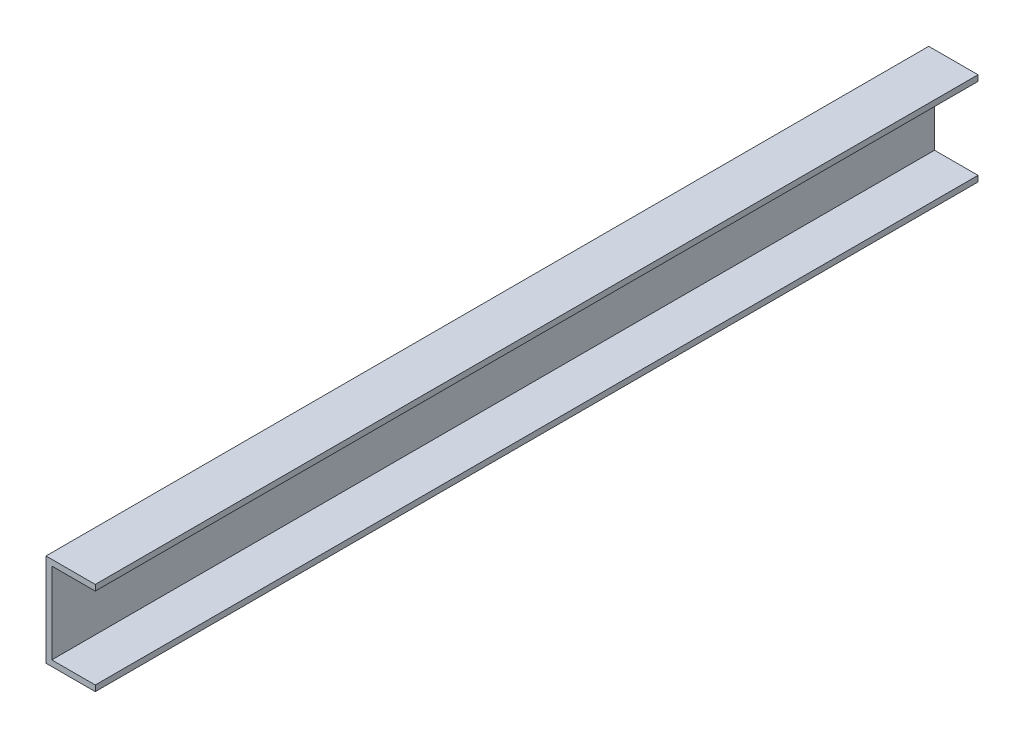
ISO-10303-21;
HEADER;
FILE_DESCRIPTION(('STEP AP214'),'2;1');
FILE_NAME('part.step','',(''),(''),'','','');
FILE_SCHEMA(('AUTOMOTIVE_DESIGN { 1 0 10303 214 1 1 1 1 }'));
ENDSEC;
DATA;
#1=APPLICATION_CONTEXT('core data for automotive mechanical design processes');
#2=APPLICATION_PROTOCOL_DEFINITION('international standard','automotive_design',2000,#1);
#3=PRODUCT_CONTEXT('',#1,'mechanical');
#4=PRODUCT('Part','Part','',(#3));
#5=PRODUCT_RELATED_PRODUCT_CATEGORY('part','',(#4));
#6=PRODUCT_DEFINITION_FORMATION('','',#4);
#7=PRODUCT_DEFINITION_CONTEXT('part definition',#1,'design');
#8=PRODUCT_DEFINITION('design','',#6,#7);
#9=PRODUCT_DEFINITION_SHAPE('','',#8);
#10=(LENGTH_UNIT() NAMED_UNIT(*) SI_UNIT(.MILLI.,.METRE.));
#11=(NAMED_UNIT(*) PLANE_ANGLE_UNIT() SI_UNIT($,.RADIAN.));
#12=(NAMED_UNIT(*) SI_UNIT($,.STERADIAN.) SOLID_ANGLE_UNIT());
#13=UNCERTAINTY_MEASURE_WITH_UNIT(LENGTH_MEASURE(1.E-05),#10,'distance_accuracy_value','');
#14=(GEOMETRIC_REPRESENTATION_CONTEXT(3) GLOBAL_UNCERTAINTY_ASSIGNED_CONTEXT((#13)) GLOBAL_UNIT_ASSIGNED_CONTEXT((#10,
#11,#12)) REPRESENTATION_CONTEXT('',''));
#15=CARTESIAN_POINT('',(0.,0.,0.));
#16=DIRECTION('',(0.,0.,1.));
#17=DIRECTION('',(1.,0.,0.));
#18=AXIS2_PLACEMENT_3D('',#15,#16,#17);
#19=CARTESIAN_POINT('',(0.,0.,241.3));
#20=DIRECTION('',(1.,0.,0.));
#21=DIRECTION('',(0.,0.,-1.));
#22=AXIS2_PLACEMENT_3D('',#19,#20,#21);
#23=PLANE('',#22);
#24=DIRECTION('',(0.,-1.,0.));
#25=VECTOR('',#24,1.);
#26=CARTESIAN_POINT('',(0.,0.,-241.3));
#27=LINE('',#26,#25);
#28=CARTESIAN_POINT('',(0.,50.8,-241.3));
#29=VERTEX_POINT('',#28);
#30=CARTESIAN_POINT('',(0.,0.,-241.3));
#31=VERTEX_POINT('',#30);
#32=EDGE_CURVE('E128',#29,#31,#27,.T.);
#33=ORIENTED_EDGE('',*,*,#32,.T.);
#34=DIRECTION('',(0.,0.,-1.));
#35=VECTOR('',#34,1.);
#36=CARTESIAN_POINT('',(0.,0.,241.3));
#37=LINE('',#36,#35);
#38=CARTESIAN_POINT('',(0.,0.,241.3));
#39=VERTEX_POINT('',#38);
#40=EDGE_CURVE('E11',#39,#31,#37,.T.);
#41=ORIENTED_EDGE('',*,*,#40,.F.);
#42=DIRECTION('',(0.,-1.,0.));
#43=VECTOR('',#42,1.);
#44=CARTESIAN_POINT('',(0.,0.,241.3));
#45=LINE('',#44,#43);
#46=CARTESIAN_POINT('',(0.,50.8,241.3));
#47=VERTEX_POINT('',#46);
#48=EDGE_CURVE('E142',#47,#39,#45,.T.);
#49=ORIENTED_EDGE('',*,*,#48,.F.);
#50=DIRECTION('',(0.,0.,-1.));
#51=VECTOR('',#50,1.);
#52=CARTESIAN_POINT('',(0.,50.8,241.3));
#53=LINE('',#52,#51);
#54=EDGE_CURVE('E124',#47,#29,#53,.T.);
#55=ORIENTED_EDGE('',*,*,#54,.T.);
#56=EDGE_LOOP('',(#33,#41,#49,#55));
#57=FACE_BOUND('',#56,.T.);
#58=ADVANCED_FACE('F32',(#57),#23,.F.);
#59=CARTESIAN_POINT('',(0.,0.,241.3));
#60=DIRECTION('',(0.,1.,0.));
#61=DIRECTION('',(0.,0.,1.));
#62=AXIS2_PLACEMENT_3D('',#59,#60,#61);
#63=PLANE('',#62);
#64=DIRECTION('',(1.,0.,0.));
#65=VECTOR('',#64,1.);
#66=CARTESIAN_POINT('',(0.,0.,-241.3));
#67=LINE('',#66,#65);
#68=CARTESIAN_POINT('',(26.9310158758704,0.,-241.3));
#69=VERTEX_POINT('',#68);
#70=EDGE_CURVE('E131',#31,#69,#67,.T.);
#71=ORIENTED_EDGE('',*,*,#70,.T.);
#72=DIRECTION('',(0.,0.,-1.));
#73=VECTOR('',#72,1.);
#74=CARTESIAN_POINT('',(26.9310158758704,0.,241.3));
#75=LINE('',#74,#73);
#76=CARTESIAN_POINT('',(26.9310158758704,0.,241.3));
#77=VERTEX_POINT('',#76);
#78=EDGE_CURVE('E40',#77,#69,#75,.T.);
#79=ORIENTED_EDGE('',*,*,#78,.F.);
#80=DIRECTION('',(1.,0.,0.));
#81=VECTOR('',#80,1.);
#82=CARTESIAN_POINT('',(0.,0.,241.3));
#83=LINE('',#82,#81);
#84=EDGE_CURVE('E91',#39,#77,#83,.T.);
#85=ORIENTED_EDGE('',*,*,#84,.F.);
#86=ORIENTED_EDGE('',*,*,#40,.T.);
#87=EDGE_LOOP('',(#71,#79,#85,#86));
#88=FACE_BOUND('',#87,.T.);
#89=ADVANCED_FACE('F177',(#88),#63,.F.);
#90=CARTESIAN_POINT('',(26.9310158758704,3.175,241.3));
#91=DIRECTION('',(-1.,0.,0.));
#92=DIRECTION('',(0.,0.,1.));
#93=AXIS2_PLACEMENT_3D('',#90,#91,#92);
#94=PLANE('',#93);
#95=DIRECTION('',(0.,1.,0.));
#96=VECTOR('',#95,1.);
#97=CARTESIAN_POINT('',(26.9310158758704,3.175,-241.3));
#98=LINE('',#97,#96);
#99=CARTESIAN_POINT('',(26.9310158758704,3.175,-241.3));
#100=VERTEX_POINT('',#99);
#101=EDGE_CURVE('E133',#69,#100,#98,.T.);
#102=ORIENTED_EDGE('',*,*,#101,.T.);
#103=DIRECTION('',(0.,0.,-1.));
#104=VECTOR('',#103,1.);
#105=CARTESIAN_POINT('',(26.9310158758704,3.175,241.3));
#106=LINE('',#105,#104);
#107=CARTESIAN_POINT('',(26.9310158758704,3.175,241.3));
#108=VERTEX_POINT('',#107);
#109=EDGE_CURVE('E149',#108,#100,#106,.T.);
#110=ORIENTED_EDGE('',*,*,#109,.F.);
#111=DIRECTION('',(0.,1.,0.));
#112=VECTOR('',#111,1.);
#113=CARTESIAN_POINT('',(26.9310158758704,3.175,241.3));
#114=LINE('',#113,#112);
#115=EDGE_CURVE('E157',#77,#108,#114,.T.);
#116=ORIENTED_EDGE('',*,*,#115,.F.);
#117=ORIENTED_EDGE('',*,*,#78,.T.);
#118=EDGE_LOOP('',(#102,#110,#116,#117));
#119=FACE_BOUND('',#118,.T.);
#120=ADVANCED_FACE('F155',(#119),#94,.F.);
#121=CARTESIAN_POINT('',(3.17500000000001,3.175,241.3));
#122=DIRECTION('',(0.,-1.,0.));
#123=DIRECTION('',(0.,0.,-1.));
#124=AXIS2_PLACEMENT_3D('',#121,#122,#123);
#125=PLANE('',#124);
#126=DIRECTION('',(-1.,0.,0.));
#127=VECTOR('',#126,1.);
#128=CARTESIAN_POINT('',(3.17500000000001,3.175,-241.3));
#129=LINE('',#128,#127);
#130=CARTESIAN_POINT('',(3.17500000000001,3.175,-241.3));
#131=VERTEX_POINT('',#130);
#132=EDGE_CURVE('E135',#100,#131,#129,.T.);
#133=ORIENTED_EDGE('',*,*,#132,.T.);
#134=DIRECTION('',(0.,0.,-1.));
#135=VECTOR('',#134,1.);
#136=CARTESIAN_POINT('',(3.17500000000001,3.175,241.3));
#137=LINE('',#136,#135);
#138=CARTESIAN_POINT('',(3.17500000000001,3.175,241.3));
#139=VERTEX_POINT('',#138);
#140=EDGE_CURVE('E146',#139,#131,#137,.T.);
#141=ORIENTED_EDGE('',*,*,#140,.F.);
#142=DIRECTION('',(-1.,0.,0.));
#143=VECTOR('',#142,1.);
#144=CARTESIAN_POINT('',(3.17500000000001,3.175,241.3));
#145=LINE('',#144,#143);
#146=EDGE_CURVE('E169',#108,#139,#145,.T.);
#147=ORIENTED_EDGE('',*,*,#146,.F.);
#148=ORIENTED_EDGE('',*,*,#109,.T.);
#149=EDGE_LOOP('',(#133,#141,#147,#148));
#150=FACE_BOUND('',#149,.T.);
#151=ADVANCED_FACE('F165',(#150),#125,.F.);
#152=CARTESIAN_POINT('',(3.175,47.625,241.3));
#153=DIRECTION('',(-1.,0.,0.));
#154=DIRECTION('',(0.,-1.,0.));
#155=AXIS2_PLACEMENT_3D('',#152,#153,#154);
#156=PLANE('',#155);
#157=DIRECTION('',(0.,1.,0.));
#158=VECTOR('',#157,1.);
#159=CARTESIAN_POINT('',(3.175,47.625,-241.3));
#160=LINE('',#159,#158);
#161=CARTESIAN_POINT('',(3.175,47.625,-241.3));
#162=VERTEX_POINT('',#161);
#163=EDGE_CURVE('E137',#131,#162,#160,.T.);
#164=ORIENTED_EDGE('',*,*,#163,.T.);
#165=DIRECTION('',(0.,0.,-1.));
#166=VECTOR('',#165,1.);
#167=CARTESIAN_POINT('',(3.175,47.625,241.3));
#168=LINE('',#167,#166);
#169=CARTESIAN_POINT('',(3.175,47.625,241.3));
#170=VERTEX_POINT('',#169);
#171=EDGE_CURVE('E119',#170,#162,#168,.T.);
#172=ORIENTED_EDGE('',*,*,#171,.F.);
#173=DIRECTION('',(0.,1.,0.));
#174=VECTOR('',#173,1.);
#175=CARTESIAN_POINT('',(3.175,47.625,241.3));
#176=LINE('',#175,#174);
#177=EDGE_CURVE('E110',#139,#170,#176,.T.);
#178=ORIENTED_EDGE('',*,*,#177,.F.);
#179=ORIENTED_EDGE('',*,*,#140,.T.);
#180=EDGE_LOOP('',(#164,#172,#178,#179));
#181=FACE_BOUND('',#180,.T.);
#182=ADVANCED_FACE('F168',(#181),#156,.F.);
#183=CARTESIAN_POINT('',(26.9310158758704,47.625,241.3));
#184=DIRECTION('',(0.,1.,0.));
#185=DIRECTION('',(0.,0.,1.));
#186=AXIS2_PLACEMENT_3D('',#183,#184,#185);
#187=PLANE('',#186);
#188=DIRECTION('',(1.,0.,0.));
#189=VECTOR('',#188,1.);
#190=CARTESIAN_POINT('',(26.9310158758704,47.625,-241.3));
#191=LINE('',#190,#189);
#192=CARTESIAN_POINT('',(26.9310158758704,47.625,-241.3));
#193=VERTEX_POINT('',#192);
#194=EDGE_CURVE('E118',#162,#193,#191,.T.);
#195=ORIENTED_EDGE('',*,*,#194,.T.);
#196=DIRECTION('',(0.,0.,-1.));
#197=VECTOR('',#196,1.);
#198=CARTESIAN_POINT('',(26.9310158758704,47.625,241.3));
#199=LINE('',#198,#197);
#200=CARTESIAN_POINT('',(26.9310158758704,47.625,241.3));
#201=VERTEX_POINT('',#200);
#202=EDGE_CURVE('E115',#201,#193,#199,.T.);
#203=ORIENTED_EDGE('',*,*,#202,.F.);
#204=DIRECTION('',(1.,0.,0.));
#205=VECTOR('',#204,1.);
#206=CARTESIAN_POINT('',(26.9310158758704,47.625,241.3));
#207=LINE('',#206,#205);
#208=EDGE_CURVE('E104',#170,#201,#207,.T.);
#209=ORIENTED_EDGE('',*,*,#208,.F.);
#210=ORIENTED_EDGE('',*,*,#171,.T.);
#211=EDGE_LOOP('',(#195,#203,#209,#210));
#212=FACE_BOUND('',#211,.T.);
#213=ADVANCED_FACE('F116',(#212),#187,.F.);
#214=CARTESIAN_POINT('',(26.9310158758704,50.8,241.3));
#215=DIRECTION('',(-1.,0.,0.));
#216=DIRECTION('',(0.,0.,1.));
#217=AXIS2_PLACEMENT_3D('',#214,#215,#216);
#218=PLANE('',#217);
#219=DIRECTION('',(0.,1.,0.));
#220=VECTOR('',#219,1.);
#221=CARTESIAN_POINT('',(26.9310158758704,50.8,-241.3));
#222=LINE('',#221,#220);
#223=CARTESIAN_POINT('',(26.9310158758704,50.8,-241.3));
#224=VERTEX_POINT('',#223);
#225=EDGE_CURVE('E77',#193,#224,#222,.T.);
#226=ORIENTED_EDGE('',*,*,#225,.T.);
#227=DIRECTION('',(0.,0.,-1.));
#228=VECTOR('',#227,1.);
#229=CARTESIAN_POINT('',(26.9310158758704,50.8,241.3));
#230=LINE('',#229,#228);
#231=CARTESIAN_POINT('',(26.9310158758704,50.8,241.3));
#232=VERTEX_POINT('',#231);
#233=EDGE_CURVE('E120',#232,#224,#230,.T.);
#234=ORIENTED_EDGE('',*,*,#233,.F.);
#235=DIRECTION('',(0.,1.,0.));
#236=VECTOR('',#235,1.);
#237=CARTESIAN_POINT('',(26.9310158758704,50.8,241.3));
#238=LINE('',#237,#236);
#239=EDGE_CURVE('E108',#201,#232,#238,.T.);
#240=ORIENTED_EDGE('',*,*,#239,.F.);
#241=ORIENTED_EDGE('',*,*,#202,.T.);
#242=EDGE_LOOP('',(#226,#234,#240,#241));
#243=FACE_BOUND('',#242,.T.);
#244=ADVANCED_FACE('F122',(#243),#218,.F.);
#245=CARTESIAN_POINT('',(0.,50.8,241.3));
#246=DIRECTION('',(0.,-1.,0.));
#247=DIRECTION('',(0.,0.,-1.));
#248=AXIS2_PLACEMENT_3D('',#245,#246,#247);
#249=PLANE('',#248);
#250=DIRECTION('',(-1.,0.,0.));
#251=VECTOR('',#250,1.);
#252=CARTESIAN_POINT('',(0.,50.8,-241.3));
#253=LINE('',#252,#251);
#254=EDGE_CURVE('E83',#224,#29,#253,.T.);
#255=ORIENTED_EDGE('',*,*,#254,.T.);
#256=ORIENTED_EDGE('',*,*,#54,.F.);
#257=DIRECTION('',(-1.,0.,0.));
#258=VECTOR('',#257,1.);
#259=CARTESIAN_POINT('',(0.,50.8,241.3));
#260=LINE('',#259,#258);
#261=EDGE_CURVE('E48',#232,#47,#260,.T.);
#262=ORIENTED_EDGE('',*,*,#261,.F.);
#263=ORIENTED_EDGE('',*,*,#233,.T.);
#264=EDGE_LOOP('',(#255,#256,#262,#263));
#265=FACE_BOUND('',#264,.T.);
#266=ADVANCED_FACE('F193',(#265),#249,.F.);
#267=CARTESIAN_POINT('',(0.,0.,241.3));
#268=DIRECTION('',(0.,0.,-1.));
#269=DIRECTION('',(-1.,0.,0.));
#270=AXIS2_PLACEMENT_3D('',#267,#268,#269);
#271=PLANE('',#270);
#272=ORIENTED_EDGE('',*,*,#48,.T.);
#273=ORIENTED_EDGE('',*,*,#84,.T.);
#274=ORIENTED_EDGE('',*,*,#115,.T.);
#275=ORIENTED_EDGE('',*,*,#146,.T.);
#276=ORIENTED_EDGE('',*,*,#177,.T.);
#277=ORIENTED_EDGE('',*,*,#208,.T.);
#278=ORIENTED_EDGE('',*,*,#239,.T.);
#279=ORIENTED_EDGE('',*,*,#261,.T.);
#280=EDGE_LOOP('',(#272,#273,#274,#275,#276,#277,#278,#279));
#281=FACE_BOUND('',#280,.T.);
#282=ADVANCED_FACE('F106',(#281),#271,.F.);
#283=CARTESIAN_POINT('',(0.,0.,-241.3));
#284=DIRECTION('',(0.,0.,-1.));
#285=DIRECTION('',(-1.,0.,0.));
#286=AXIS2_PLACEMENT_3D('',#283,#284,#285);
#287=PLANE('',#286);
#288=ORIENTED_EDGE('',*,*,#32,.F.);
#289=ORIENTED_EDGE('',*,*,#254,.F.);
#290=ORIENTED_EDGE('',*,*,#225,.F.);
#291=ORIENTED_EDGE('',*,*,#194,.F.);
#292=ORIENTED_EDGE('',*,*,#163,.F.);
#293=ORIENTED_EDGE('',*,*,#132,.F.);
#294=ORIENTED_EDGE('',*,*,#101,.F.);
#295=ORIENTED_EDGE('',*,*,#70,.F.);
#296=EDGE_LOOP('',(#288,#289,#290,#291,#292,#293,#294,#295));
#297=FACE_BOUND('',#296,.T.);
#298=ADVANCED_FACE('F161',(#297),#287,.T.);
#299=CLOSED_SHELL('',(#58,#89,#120,#151,#182,#213,#244,#266,#282,#298));
#300=MANIFOLD_SOLID_BREP('B2',#299);
#301=ADVANCED_BREP_SHAPE_REPRESENTATION('',(#18,#300),#14);
#302=SHAPE_DEFINITION_REPRESENTATION(#9,#301);
ENDSEC;
END-ISO-10303-21;
